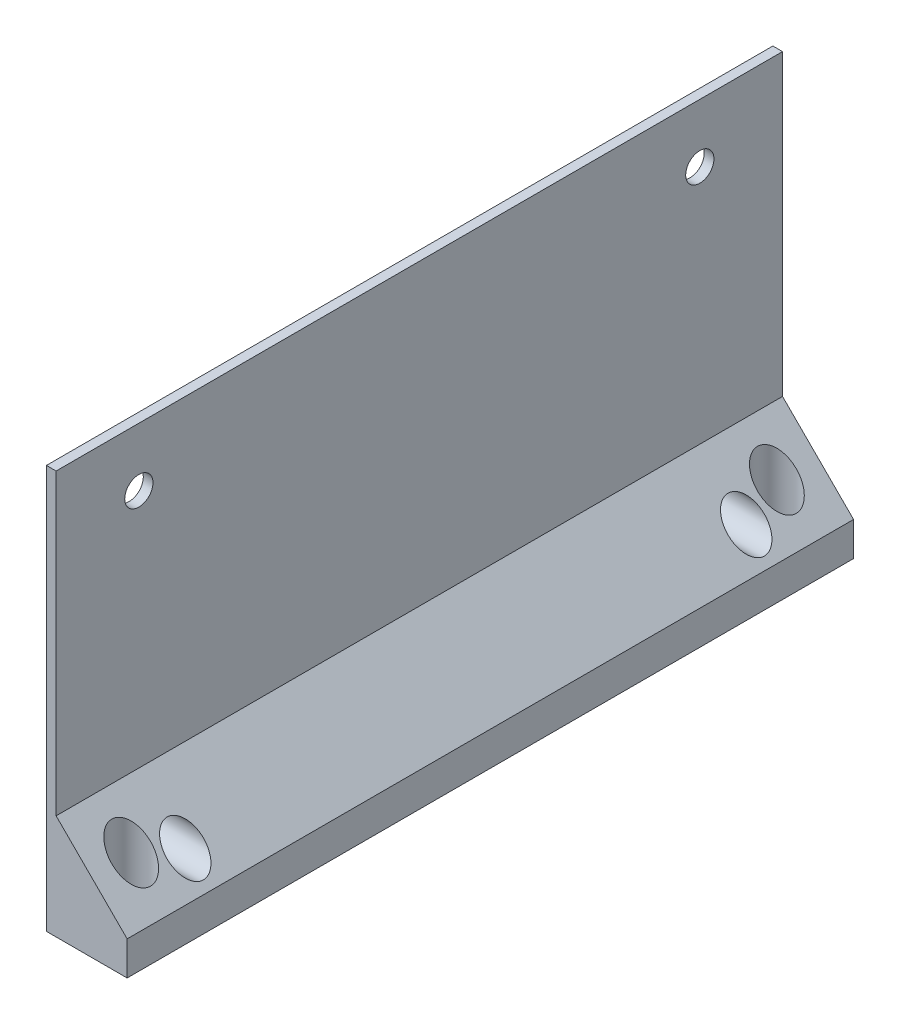
ISO-10303-21;
HEADER;
FILE_DESCRIPTION(('STEP AP214'),'2;1');
FILE_NAME('part.step','',(''),(''),'','','');
FILE_SCHEMA(('AUTOMOTIVE_DESIGN { 1 0 10303 214 1 1 1 1 }'));
ENDSEC;
DATA;
#1=APPLICATION_CONTEXT('core data for automotive mechanical design processes');
#2=APPLICATION_PROTOCOL_DEFINITION('international standard','automotive_design',2000,#1);
#3=PRODUCT_CONTEXT('',#1,'mechanical');
#4=PRODUCT('Part','Part','',(#3));
#5=PRODUCT_RELATED_PRODUCT_CATEGORY('part','',(#4));
#6=PRODUCT_DEFINITION_FORMATION('','',#4);
#7=PRODUCT_DEFINITION_CONTEXT('part definition',#1,'design');
#8=PRODUCT_DEFINITION('design','',#6,#7);
#9=PRODUCT_DEFINITION_SHAPE('','',#8);
#10=(LENGTH_UNIT() NAMED_UNIT(*) SI_UNIT(.MILLI.,.METRE.));
#11=(NAMED_UNIT(*) PLANE_ANGLE_UNIT() SI_UNIT($,.RADIAN.));
#12=(NAMED_UNIT(*) SI_UNIT($,.STERADIAN.) SOLID_ANGLE_UNIT());
#13=UNCERTAINTY_MEASURE_WITH_UNIT(LENGTH_MEASURE(1.E-05),#10,'distance_accuracy_value','');
#14=(GEOMETRIC_REPRESENTATION_CONTEXT(3) GLOBAL_UNCERTAINTY_ASSIGNED_CONTEXT((#13)) GLOBAL_UNIT_ASSIGNED_CONTEXT((#10,
#11,#12)) REPRESENTATION_CONTEXT('',''));
#15=CARTESIAN_POINT('',(0.,0.,0.));
#16=DIRECTION('',(0.,0.,1.));
#17=DIRECTION('',(1.,0.,0.));
#18=AXIS2_PLACEMENT_3D('',#15,#16,#17);
#19=CARTESIAN_POINT('',(0.,0.,90.));
#20=DIRECTION('',(1.,0.,0.));
#21=DIRECTION('',(0.,0.,-1.));
#22=AXIS2_PLACEMENT_3D('',#19,#20,#21);
#23=PLANE('',#22);
#24=CARTESIAN_POINT('',(0.,42.75,79.75));
#25=DIRECTION('',(-1.,0.,0.));
#26=DIRECTION('',(0.,0.,1.));
#27=AXIS2_PLACEMENT_3D('',#24,#25,#26);
#28=CIRCLE('',#27,1.75);
#29=CARTESIAN_POINT('',(0.,42.75,81.5));
#30=VERTEX_POINT('',#29);
#31=EDGE_CURVE('E154',#30,#30,#28,.T.);
#32=ORIENTED_EDGE('',*,*,#31,.F.);
#33=EDGE_LOOP('',(#32));
#34=FACE_BOUND('',#33,.T.);
#35=CARTESIAN_POINT('',(0.,7.25000000000001,79.75));
#36=DIRECTION('',(-1.,0.,0.));
#37=DIRECTION('',(0.,0.,1.));
#38=AXIS2_PLACEMENT_3D('',#35,#36,#37);
#39=CIRCLE('',#38,1.75);
#40=CARTESIAN_POINT('',(0.,7.25000000000001,81.5));
#41=VERTEX_POINT('',#40);
#42=EDGE_CURVE('E196',#41,#41,#39,.T.);
#43=ORIENTED_EDGE('',*,*,#42,.F.);
#44=EDGE_LOOP('',(#43));
#45=FACE_BOUND('',#44,.T.);
#46=CARTESIAN_POINT('',(0.,7.25000000000001,10.25));
#47=DIRECTION('',(-1.,0.,0.));
#48=DIRECTION('',(0.,0.,1.));
#49=AXIS2_PLACEMENT_3D('',#46,#47,#48);
#50=CIRCLE('',#49,1.75);
#51=CARTESIAN_POINT('',(0.,7.25000000000001,12.));
#52=VERTEX_POINT('',#51);
#53=EDGE_CURVE('E192',#52,#52,#50,.T.);
#54=ORIENTED_EDGE('',*,*,#53,.F.);
#55=EDGE_LOOP('',(#54));
#56=FACE_BOUND('',#55,.T.);
#57=CARTESIAN_POINT('',(0.,42.75,10.25));
#58=DIRECTION('',(-1.,0.,0.));
#59=DIRECTION('',(0.,0.,1.));
#60=AXIS2_PLACEMENT_3D('',#57,#58,#59);
#61=CIRCLE('',#60,1.75);
#62=CARTESIAN_POINT('',(0.,42.75,12.));
#63=VERTEX_POINT('',#62);
#64=EDGE_CURVE('E141',#63,#63,#61,.T.);
#65=ORIENTED_EDGE('',*,*,#64,.F.);
#66=EDGE_LOOP('',(#65));
#67=FACE_BOUND('',#66,.T.);
#68=DIRECTION('',(0.,-1.,0.));
#69=VECTOR('',#68,1.);
#70=CARTESIAN_POINT('',(0.,0.,0.));
#71=LINE('',#70,#69);
#72=CARTESIAN_POINT('',(0.,50.,0.));
#73=VERTEX_POINT('',#72);
#74=CARTESIAN_POINT('',(0.,0.,0.));
#75=VERTEX_POINT('',#74);
#76=EDGE_CURVE('E123',#73,#75,#71,.T.);
#77=ORIENTED_EDGE('',*,*,#76,.T.);
#78=DIRECTION('',(0.,0.,-1.));
#79=VECTOR('',#78,1.);
#80=CARTESIAN_POINT('',(0.,0.,90.));
#81=LINE('',#80,#79);
#82=CARTESIAN_POINT('',(0.,0.,90.));
#83=VERTEX_POINT('',#82);
#84=EDGE_CURVE('E105',#83,#75,#81,.T.);
#85=ORIENTED_EDGE('',*,*,#84,.F.);
#86=DIRECTION('',(0.,-1.,0.));
#87=VECTOR('',#86,1.);
#88=CARTESIAN_POINT('',(0.,0.,90.));
#89=LINE('',#88,#87);
#90=CARTESIAN_POINT('',(0.,50.,90.));
#91=VERTEX_POINT('',#90);
#92=EDGE_CURVE('E110',#91,#83,#89,.T.);
#93=ORIENTED_EDGE('',*,*,#92,.F.);
#94=DIRECTION('',(0.,0.,-1.));
#95=VECTOR('',#94,1.);
#96=CARTESIAN_POINT('',(0.,50.,90.));
#97=LINE('',#96,#95);
#98=EDGE_CURVE('E213',#91,#73,#97,.T.);
#99=ORIENTED_EDGE('',*,*,#98,.T.);
#100=EDGE_LOOP('',(#77,#85,#93,#99));
#101=FACE_BOUND('',#100,.T.);
#102=ADVANCED_FACE('F49',(#34,#45,#56,#67,#101),#23,.F.);
#103=CARTESIAN_POINT('',(0.,0.,90.));
#104=DIRECTION('',(0.,1.,0.));
#105=DIRECTION('',(0.,0.,1.));
#106=AXIS2_PLACEMENT_3D('',#103,#104,#105);
#107=PLANE('',#106);
#108=CARTESIAN_POINT('',(5.49999999999999,0.,85.));
#109=DIRECTION('',(0.,-1.,0.));
#110=DIRECTION('',(0.,0.,-1.));
#111=AXIS2_PLACEMENT_3D('',#108,#109,#110);
#112=CIRCLE('',#111,2.4);
#113=CARTESIAN_POINT('',(5.49999999999999,0.,82.6));
#114=VERTEX_POINT('',#113);
#115=EDGE_CURVE('E158',#114,#114,#112,.T.);
#116=ORIENTED_EDGE('',*,*,#115,.F.);
#117=EDGE_LOOP('',(#116));
#118=FACE_BOUND('',#117,.T.);
#119=CARTESIAN_POINT('',(5.5,0.,5.));
#120=DIRECTION('',(0.,-1.,0.));
#121=DIRECTION('',(0.,0.,-1.));
#122=AXIS2_PLACEMENT_3D('',#119,#120,#121);
#123=CIRCLE('',#122,2.4);
#124=CARTESIAN_POINT('',(5.5,0.,2.6));
#125=VERTEX_POINT('',#124);
#126=EDGE_CURVE('E168',#125,#125,#123,.T.);
#127=ORIENTED_EDGE('',*,*,#126,.F.);
#128=EDGE_LOOP('',(#127));
#129=FACE_BOUND('',#128,.T.);
#130=DIRECTION('',(1.,0.,0.));
#131=VECTOR('',#130,1.);
#132=CARTESIAN_POINT('',(0.,0.,0.));
#133=LINE('',#132,#131);
#134=CARTESIAN_POINT('',(10.,0.,0.));
#135=VERTEX_POINT('',#134);
#136=EDGE_CURVE('E216',#75,#135,#133,.T.);
#137=ORIENTED_EDGE('',*,*,#136,.T.);
#138=DIRECTION('',(0.,0.,-1.));
#139=VECTOR('',#138,1.);
#140=CARTESIAN_POINT('',(10.,0.,90.));
#141=LINE('',#140,#139);
#142=CARTESIAN_POINT('',(10.,0.,90.));
#143=VERTEX_POINT('',#142);
#144=EDGE_CURVE('E108',#143,#135,#141,.T.);
#145=ORIENTED_EDGE('',*,*,#144,.F.);
#146=DIRECTION('',(1.,0.,0.));
#147=VECTOR('',#146,1.);
#148=CARTESIAN_POINT('',(0.,0.,90.));
#149=LINE('',#148,#147);
#150=EDGE_CURVE('E101',#83,#143,#149,.T.);
#151=ORIENTED_EDGE('',*,*,#150,.F.);
#152=ORIENTED_EDGE('',*,*,#84,.T.);
#153=EDGE_LOOP('',(#137,#145,#151,#152));
#154=FACE_BOUND('',#153,.T.);
#155=ADVANCED_FACE('F103',(#118,#129,#154),#107,.F.);
#156=CARTESIAN_POINT('',(10.,0.,90.));
#157=DIRECTION('',(-1.,0.,0.));
#158=DIRECTION('',(0.,0.,1.));
#159=AXIS2_PLACEMENT_3D('',#156,#157,#158);
#160=PLANE('',#159);
#161=DIRECTION('',(0.,1.,0.));
#162=VECTOR('',#161,1.);
#163=CARTESIAN_POINT('',(10.,0.,0.));
#164=LINE('',#163,#162);
#165=CARTESIAN_POINT('',(10.,4.19999999999999,0.));
#166=VERTEX_POINT('',#165);
#167=EDGE_CURVE('E219',#135,#166,#164,.T.);
#168=ORIENTED_EDGE('',*,*,#167,.T.);
#169=DIRECTION('',(0.,0.,-1.));
#170=VECTOR('',#169,1.);
#171=CARTESIAN_POINT('',(10.,4.19999999999999,90.));
#172=LINE('',#171,#170);
#173=CARTESIAN_POINT('',(10.,4.19999999999999,90.));
#174=VERTEX_POINT('',#173);
#175=EDGE_CURVE('E61',#166,#174,#172,.F.);
#176=ORIENTED_EDGE('',*,*,#175,.T.);
#177=DIRECTION('',(0.,1.,0.));
#178=VECTOR('',#177,1.);
#179=CARTESIAN_POINT('',(10.,0.,90.));
#180=LINE('',#179,#178);
#181=EDGE_CURVE('E67',#143,#174,#180,.T.);
#182=ORIENTED_EDGE('',*,*,#181,.F.);
#183=ORIENTED_EDGE('',*,*,#144,.T.);
#184=EDGE_LOOP('',(#168,#176,#182,#183));
#185=FACE_BOUND('',#184,.T.);
#186=ADVANCED_FACE('F241',(#185),#160,.F.);
#187=CARTESIAN_POINT('',(1.2,3.,90.));
#188=DIRECTION('',(-1.,0.,0.));
#189=DIRECTION('',(0.,0.,1.));
#190=AXIS2_PLACEMENT_3D('',#187,#188,#189);
#191=PLANE('',#190);
#192=CARTESIAN_POINT('',(1.2,42.75,79.75));
#193=DIRECTION('',(-1.,0.,0.));
#194=DIRECTION('',(0.,0.,1.));
#195=AXIS2_PLACEMENT_3D('',#192,#193,#194);
#196=CIRCLE('',#195,1.75);
#197=CARTESIAN_POINT('',(1.2,42.75,81.5));
#198=VERTEX_POINT('',#197);
#199=EDGE_CURVE('E140',#198,#198,#196,.T.);
#200=ORIENTED_EDGE('',*,*,#199,.T.);
#201=EDGE_LOOP('',(#200));
#202=FACE_BOUND('',#201,.T.);
#203=CARTESIAN_POINT('',(1.2,42.75,10.25));
#204=DIRECTION('',(-1.,0.,0.));
#205=DIRECTION('',(0.,0.,1.));
#206=AXIS2_PLACEMENT_3D('',#203,#204,#205);
#207=CIRCLE('',#206,1.75);
#208=CARTESIAN_POINT('',(1.2,42.75,12.));
#209=VERTEX_POINT('',#208);
#210=EDGE_CURVE('E136',#209,#209,#207,.T.);
#211=ORIENTED_EDGE('',*,*,#210,.T.);
#212=EDGE_LOOP('',(#211));
#213=FACE_BOUND('',#212,.T.);
#214=DIRECTION('',(0.,1.,0.));
#215=VECTOR('',#214,1.);
#216=CARTESIAN_POINT('',(1.2,3.,90.));
#217=LINE('',#216,#215);
#218=CARTESIAN_POINT('',(1.2,13.,90.));
#219=VERTEX_POINT('',#218);
#220=CARTESIAN_POINT('',(1.2,50.,90.));
#221=VERTEX_POINT('',#220);
#222=EDGE_CURVE('E208',#219,#221,#217,.T.);
#223=ORIENTED_EDGE('',*,*,#222,.F.);
#224=DIRECTION('',(0.,0.,-1.));
#225=VECTOR('',#224,1.);
#226=CARTESIAN_POINT('',(1.2,13.,0.));
#227=LINE('',#226,#225);
#228=CARTESIAN_POINT('',(1.2,13.,0.));
#229=VERTEX_POINT('',#228);
#230=EDGE_CURVE('E125',#219,#229,#227,.T.);
#231=ORIENTED_EDGE('',*,*,#230,.T.);
#232=DIRECTION('',(0.,1.,0.));
#233=VECTOR('',#232,1.);
#234=CARTESIAN_POINT('',(1.2,3.,0.));
#235=LINE('',#234,#233);
#236=CARTESIAN_POINT('',(1.2,50.,0.));
#237=VERTEX_POINT('',#236);
#238=EDGE_CURVE('E222',#229,#237,#235,.T.);
#239=ORIENTED_EDGE('',*,*,#238,.T.);
#240=DIRECTION('',(0.,0.,-1.));
#241=VECTOR('',#240,1.);
#242=CARTESIAN_POINT('',(1.2,50.,90.));
#243=LINE('',#242,#241);
#244=EDGE_CURVE('E132',#221,#237,#243,.T.);
#245=ORIENTED_EDGE('',*,*,#244,.F.);
#246=EDGE_LOOP('',(#223,#231,#239,#245));
#247=FACE_BOUND('',#246,.T.);
#248=ADVANCED_FACE('F247',(#202,#213,#247),#191,.F.);
#249=CARTESIAN_POINT('',(0.,50.,90.));
#250=DIRECTION('',(0.,-1.,0.));
#251=DIRECTION('',(0.,0.,-1.));
#252=AXIS2_PLACEMENT_3D('',#249,#250,#251);
#253=PLANE('',#252);
#254=DIRECTION('',(-1.,0.,0.));
#255=VECTOR('',#254,1.);
#256=CARTESIAN_POINT('',(0.,50.,0.));
#257=LINE('',#256,#255);
#258=EDGE_CURVE('E120',#237,#73,#257,.T.);
#259=ORIENTED_EDGE('',*,*,#258,.T.);
#260=ORIENTED_EDGE('',*,*,#98,.F.);
#261=DIRECTION('',(-1.,0.,0.));
#262=VECTOR('',#261,1.);
#263=CARTESIAN_POINT('',(0.,50.,90.));
#264=LINE('',#263,#262);
#265=EDGE_CURVE('E115',#221,#91,#264,.T.);
#266=ORIENTED_EDGE('',*,*,#265,.F.);
#267=ORIENTED_EDGE('',*,*,#244,.T.);
#268=EDGE_LOOP('',(#259,#260,#266,#267));
#269=FACE_BOUND('',#268,.T.);
#270=ADVANCED_FACE('F233',(#269),#253,.F.);
#271=CARTESIAN_POINT('',(0.,0.,90.));
#272=DIRECTION('',(0.,0.,-1.));
#273=DIRECTION('',(-1.,0.,0.));
#274=AXIS2_PLACEMENT_3D('',#271,#272,#273);
#275=PLANE('',#274);
#276=ORIENTED_EDGE('',*,*,#92,.T.);
#277=ORIENTED_EDGE('',*,*,#150,.T.);
#278=ORIENTED_EDGE('',*,*,#181,.T.);
#279=DIRECTION('',(0.707106781186547,-0.707106781186548,0.));
#280=VECTOR('',#279,1.);
#281=CARTESIAN_POINT('',(7.1,7.1,90.));
#282=LINE('',#281,#280);
#283=EDGE_CURVE('E13',#174,#219,#282,.F.);
#284=ORIENTED_EDGE('',*,*,#283,.T.);
#285=ORIENTED_EDGE('',*,*,#222,.T.);
#286=ORIENTED_EDGE('',*,*,#265,.T.);
#287=EDGE_LOOP('',(#276,#277,#278,#284,#285,#286));
#288=FACE_BOUND('',#287,.T.);
#289=ADVANCED_FACE('F113',(#288),#275,.F.);
#290=CARTESIAN_POINT('',(0.,0.,0.));
#291=DIRECTION('',(0.,0.,-1.));
#292=DIRECTION('',(-1.,0.,0.));
#293=AXIS2_PLACEMENT_3D('',#290,#291,#292);
#294=PLANE('',#293);
#295=ORIENTED_EDGE('',*,*,#76,.F.);
#296=ORIENTED_EDGE('',*,*,#258,.F.);
#297=ORIENTED_EDGE('',*,*,#238,.F.);
#298=DIRECTION('',(-0.707106781186547,0.707106781186548,0.));
#299=VECTOR('',#298,1.);
#300=CARTESIAN_POINT('',(1.2,13.,0.));
#301=LINE('',#300,#299);
#302=EDGE_CURVE('E130',#229,#166,#301,.F.);
#303=ORIENTED_EDGE('',*,*,#302,.T.);
#304=ORIENTED_EDGE('',*,*,#167,.F.);
#305=ORIENTED_EDGE('',*,*,#136,.F.);
#306=EDGE_LOOP('',(#295,#296,#297,#303,#304,#305));
#307=FACE_BOUND('',#306,.T.);
#308=ADVANCED_FACE('F238',(#307),#294,.T.);
#309=CARTESIAN_POINT('',(10.,42.75,10.25));
#310=DIRECTION('',(-1.,0.,0.));
#311=DIRECTION('',(0.,0.,1.));
#312=AXIS2_PLACEMENT_3D('',#309,#310,#311);
#313=CYLINDRICAL_SURFACE('',#312,1.75);
#314=ORIENTED_EDGE('',*,*,#64,.T.);
#315=EDGE_LOOP('',(#314));
#316=FACE_BOUND('',#315,.T.);
#317=ORIENTED_EDGE('',*,*,#210,.F.);
#318=EDGE_LOOP('',(#317));
#319=FACE_BOUND('',#318,.T.);
#320=ADVANCED_FACE('F273',(#316,#319),#313,.F.);
#321=CARTESIAN_POINT('',(10.,7.25000000000001,10.25));
#322=DIRECTION('',(-1.,0.,0.));
#323=DIRECTION('',(0.,0.,1.));
#324=AXIS2_PLACEMENT_3D('',#321,#322,#323);
#325=CYLINDRICAL_SURFACE('',#324,1.75);
#326=CARTESIAN_POINT('',(1.2,7.25000000000001,10.25));
#327=DIRECTION('',(-1.,0.,0.));
#328=DIRECTION('',(0.,0.,1.));
#329=AXIS2_PLACEMENT_3D('',#326,#327,#328);
#330=CIRCLE('',#329,1.75);
#331=CARTESIAN_POINT('',(1.2,7.25000000000001,12.));
#332=VERTEX_POINT('',#331);
#333=EDGE_CURVE('E170',#332,#332,#330,.T.);
#334=ORIENTED_EDGE('',*,*,#333,.F.);
#335=EDGE_LOOP('',(#334));
#336=FACE_BOUND('',#335,.T.);
#337=ORIENTED_EDGE('',*,*,#53,.T.);
#338=EDGE_LOOP('',(#337));
#339=FACE_BOUND('',#338,.T.);
#340=ADVANCED_FACE('F276',(#336,#339),#325,.F.);
#341=CARTESIAN_POINT('',(10.,7.25000000000001,79.75));
#342=DIRECTION('',(-1.,0.,0.));
#343=DIRECTION('',(0.,0.,1.));
#344=AXIS2_PLACEMENT_3D('',#341,#342,#343);
#345=CYLINDRICAL_SURFACE('',#344,1.75);
#346=CARTESIAN_POINT('',(1.2,7.25000000000001,79.75));
#347=DIRECTION('',(-1.,0.,0.));
#348=DIRECTION('',(0.,0.,1.));
#349=AXIS2_PLACEMENT_3D('',#346,#347,#348);
#350=CIRCLE('',#349,1.75);
#351=CARTESIAN_POINT('',(1.2,7.25000000000001,81.5));
#352=VERTEX_POINT('',#351);
#353=EDGE_CURVE('E176',#352,#352,#350,.T.);
#354=ORIENTED_EDGE('',*,*,#353,.F.);
#355=EDGE_LOOP('',(#354));
#356=FACE_BOUND('',#355,.T.);
#357=ORIENTED_EDGE('',*,*,#42,.T.);
#358=EDGE_LOOP('',(#357));
#359=FACE_BOUND('',#358,.T.);
#360=ADVANCED_FACE('F283',(#356,#359),#345,.F.);
#361=CARTESIAN_POINT('',(10.,42.75,79.75));
#362=DIRECTION('',(-1.,0.,0.));
#363=DIRECTION('',(0.,0.,1.));
#364=AXIS2_PLACEMENT_3D('',#361,#362,#363);
#365=CYLINDRICAL_SURFACE('',#364,1.75);
#366=ORIENTED_EDGE('',*,*,#31,.T.);
#367=EDGE_LOOP('',(#366));
#368=FACE_BOUND('',#367,.T.);
#369=ORIENTED_EDGE('',*,*,#199,.F.);
#370=EDGE_LOOP('',(#369));
#371=FACE_BOUND('',#370,.T.);
#372=ADVANCED_FACE('F289',(#368,#371),#365,.F.);
#373=CARTESIAN_POINT('',(5.5,50.,5.));
#374=DIRECTION('',(0.,-1.,0.));
#375=DIRECTION('',(0.,0.,-1.));
#376=AXIS2_PLACEMENT_3D('',#373,#374,#375);
#377=CYLINDRICAL_SURFACE('',#376,2.4);
#378=ORIENTED_EDGE('',*,*,#126,.T.);
#379=EDGE_LOOP('',(#378));
#380=FACE_BOUND('',#379,.T.);
#381=CARTESIAN_POINT('',(5.5,8.69999999999999,5.));
#382=DIRECTION('',(0.707106781186548,0.707106781186547,0.));
#383=DIRECTION('',(0.707106781186547,-0.707106781186548,0.));
#384=AXIS2_PLACEMENT_3D('',#381,#382,#383);
#385=ELLIPSE('',#384,3.39411254969543,2.4);
#386=CARTESIAN_POINT('',(7.9,6.29999999999999,5.));
#387=VERTEX_POINT('',#386);
#388=EDGE_CURVE('E155',#387,#387,#385,.F.);
#389=ORIENTED_EDGE('',*,*,#388,.F.);
#390=EDGE_LOOP('',(#389));
#391=FACE_BOUND('',#390,.T.);
#392=ADVANCED_FACE('F307',(#380,#391),#377,.F.);
#393=CARTESIAN_POINT('',(5.49999999999999,50.,85.));
#394=DIRECTION('',(0.,-1.,0.));
#395=DIRECTION('',(0.,0.,-1.));
#396=AXIS2_PLACEMENT_3D('',#393,#394,#395);
#397=CYLINDRICAL_SURFACE('',#396,2.4);
#398=ORIENTED_EDGE('',*,*,#115,.T.);
#399=EDGE_LOOP('',(#398));
#400=FACE_BOUND('',#399,.T.);
#401=CARTESIAN_POINT('',(5.49999999999999,8.70000000000001,85.));
#402=DIRECTION('',(0.707106781186548,0.707106781186547,0.));
#403=DIRECTION('',(0.707106781186547,-0.707106781186548,0.));
#404=AXIS2_PLACEMENT_3D('',#401,#402,#403);
#405=ELLIPSE('',#404,3.39411254969543,2.4);
#406=CARTESIAN_POINT('',(7.89999999999999,6.30000000000001,85.));
#407=VERTEX_POINT('',#406);
#408=EDGE_CURVE('E150',#407,#407,#405,.F.);
#409=ORIENTED_EDGE('',*,*,#408,.F.);
#410=EDGE_LOOP('',(#409));
#411=FACE_BOUND('',#410,.T.);
#412=ADVANCED_FACE('F312',(#400,#411),#397,.F.);
#413=CARTESIAN_POINT('',(1.2,13.,90.));
#414=DIRECTION('',(0.707106781186548,0.707106781186547,0.));
#415=DIRECTION('',(0.,0.,1.));
#416=AXIS2_PLACEMENT_3D('',#413,#414,#415);
#417=PLANE('',#416);
#418=CARTESIAN_POINT('',(6.94999999999998,7.25000000000001,10.25));
#419=DIRECTION('',(0.707106781186548,0.707106781186547,0.));
#420=DIRECTION('',(-0.707106781186547,0.707106781186548,0.));
#421=AXIS2_PLACEMENT_3D('',#418,#419,#420);
#422=ELLIPSE('',#421,3.18198051533946,2.25);
#423=CARTESIAN_POINT('',(4.69999999999998,9.50000000000001,10.25));
#424=VERTEX_POINT('',#423);
#425=EDGE_CURVE('E54',#424,#424,#422,.F.);
#426=ORIENTED_EDGE('',*,*,#425,.T.);
#427=EDGE_LOOP('',(#426));
#428=FACE_BOUND('',#427,.T.);
#429=CARTESIAN_POINT('',(6.94999999999998,7.25000000000001,79.75));
#430=DIRECTION('',(0.707106781186548,0.707106781186547,0.));
#431=DIRECTION('',(-0.707106781186547,0.707106781186548,0.));
#432=AXIS2_PLACEMENT_3D('',#429,#430,#431);
#433=ELLIPSE('',#432,3.18198051533946,2.25);
#434=CARTESIAN_POINT('',(4.69999999999999,9.50000000000001,79.75));
#435=VERTEX_POINT('',#434);
#436=EDGE_CURVE('E159',#435,#435,#433,.F.);
#437=ORIENTED_EDGE('',*,*,#436,.T.);
#438=EDGE_LOOP('',(#437));
#439=FACE_BOUND('',#438,.T.);
#440=ORIENTED_EDGE('',*,*,#283,.F.);
#441=ORIENTED_EDGE('',*,*,#175,.F.);
#442=ORIENTED_EDGE('',*,*,#302,.F.);
#443=ORIENTED_EDGE('',*,*,#230,.F.);
#444=EDGE_LOOP('',(#440,#441,#442,#443));
#445=FACE_BOUND('',#444,.T.);
#446=ORIENTED_EDGE('',*,*,#408,.T.);
#447=EDGE_LOOP('',(#446));
#448=FACE_BOUND('',#447,.T.);
#449=ORIENTED_EDGE('',*,*,#388,.T.);
#450=EDGE_LOOP('',(#449));
#451=FACE_BOUND('',#450,.T.);
#452=ADVANCED_FACE('F52',(#428,#439,#445,#448,#451),#417,.T.);
#453=CARTESIAN_POINT('',(10.,7.25000000000001,79.75));
#454=DIRECTION('',(-1.,0.,0.));
#455=DIRECTION('',(0.,0.,1.));
#456=AXIS2_PLACEMENT_3D('',#453,#454,#455);
#457=CYLINDRICAL_SURFACE('',#456,2.25);
#458=CARTESIAN_POINT('',(1.2,7.25000000000001,79.75));
#459=DIRECTION('',(-1.,0.,0.));
#460=DIRECTION('',(0.,0.,1.));
#461=AXIS2_PLACEMENT_3D('',#458,#459,#460);
#462=CIRCLE('',#461,2.25);
#463=CARTESIAN_POINT('',(1.2,7.25000000000001,82.));
#464=VERTEX_POINT('',#463);
#465=EDGE_CURVE('E179',#464,#464,#462,.T.);
#466=ORIENTED_EDGE('',*,*,#465,.T.);
#467=EDGE_LOOP('',(#466));
#468=FACE_BOUND('',#467,.T.);
#469=ORIENTED_EDGE('',*,*,#436,.F.);
#470=EDGE_LOOP('',(#469));
#471=FACE_BOUND('',#470,.T.);
#472=ADVANCED_FACE('F351',(#468,#471),#457,.F.);
#473=CARTESIAN_POINT('',(1.2,7.25000000000001,79.75));
#474=DIRECTION('',(-1.,0.,0.));
#475=DIRECTION('',(0.,0.,1.));
#476=AXIS2_PLACEMENT_3D('',#473,#474,#475);
#477=PLANE('',#476);
#478=ORIENTED_EDGE('',*,*,#353,.T.);
#479=EDGE_LOOP('',(#478));
#480=FACE_BOUND('',#479,.T.);
#481=ORIENTED_EDGE('',*,*,#465,.F.);
#482=EDGE_LOOP('',(#481));
#483=FACE_BOUND('',#482,.T.);
#484=ADVANCED_FACE('F361',(#480,#483),#477,.F.);
#485=CARTESIAN_POINT('',(10.,7.25000000000001,10.25));
#486=DIRECTION('',(-1.,0.,0.));
#487=DIRECTION('',(0.,0.,1.));
#488=AXIS2_PLACEMENT_3D('',#485,#486,#487);
#489=CYLINDRICAL_SURFACE('',#488,2.25);
#490=CARTESIAN_POINT('',(1.2,7.25000000000001,10.25));
#491=DIRECTION('',(-1.,0.,0.));
#492=DIRECTION('',(0.,0.,1.));
#493=AXIS2_PLACEMENT_3D('',#490,#491,#492);
#494=CIRCLE('',#493,2.25);
#495=CARTESIAN_POINT('',(1.2,7.25000000000001,12.5));
#496=VERTEX_POINT('',#495);
#497=EDGE_CURVE('E162',#496,#496,#494,.T.);
#498=ORIENTED_EDGE('',*,*,#497,.T.);
#499=EDGE_LOOP('',(#498));
#500=FACE_BOUND('',#499,.T.);
#501=ORIENTED_EDGE('',*,*,#425,.F.);
#502=EDGE_LOOP('',(#501));
#503=FACE_BOUND('',#502,.T.);
#504=ADVANCED_FACE('F372',(#500,#503),#489,.F.);
#505=CARTESIAN_POINT('',(1.2,7.25000000000001,10.25));
#506=DIRECTION('',(-1.,0.,0.));
#507=DIRECTION('',(0.,0.,1.));
#508=AXIS2_PLACEMENT_3D('',#505,#506,#507);
#509=PLANE('',#508);
#510=ORIENTED_EDGE('',*,*,#333,.T.);
#511=EDGE_LOOP('',(#510));
#512=FACE_BOUND('',#511,.T.);
#513=ORIENTED_EDGE('',*,*,#497,.F.);
#514=EDGE_LOOP('',(#513));
#515=FACE_BOUND('',#514,.T.);
#516=ADVANCED_FACE('F383',(#512,#515),#509,.F.);
#517=CLOSED_SHELL('',(#102,#155,#186,#248,#270,#289,#308,#320,#340,#360,#372,#392,#412,#452,
#472,#484,#504,#516));
#518=MANIFOLD_SOLID_BREP('B2',#517);
#519=ADVANCED_BREP_SHAPE_REPRESENTATION('',(#18,#518),#14);
#520=SHAPE_DEFINITION_REPRESENTATION(#9,#519);
ENDSEC;
END-ISO-10303-21;
